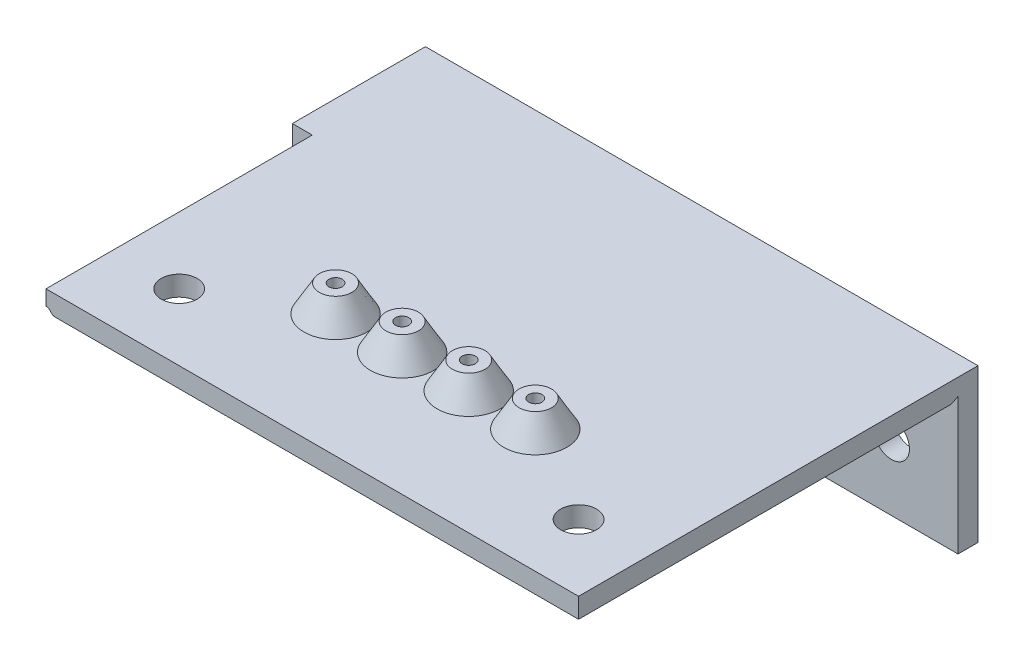
ISO-10303-21;
HEADER;
FILE_DESCRIPTION(('STEP AP214'),'2;1');
FILE_NAME('part.step','',(''),(''),'','','');
FILE_SCHEMA(('AUTOMOTIVE_DESIGN { 1 0 10303 214 1 1 1 1 }'));
ENDSEC;
DATA;
#1=APPLICATION_CONTEXT('core data for automotive mechanical design processes');
#2=APPLICATION_PROTOCOL_DEFINITION('international standard','automotive_design',2000,#1);
#3=PRODUCT_CONTEXT('',#1,'mechanical');
#4=PRODUCT('Part','Part','',(#3));
#5=PRODUCT_RELATED_PRODUCT_CATEGORY('part','',(#4));
#6=PRODUCT_DEFINITION_FORMATION('','',#4);
#7=PRODUCT_DEFINITION_CONTEXT('part definition',#1,'design');
#8=PRODUCT_DEFINITION('design','',#6,#7);
#9=PRODUCT_DEFINITION_SHAPE('','',#8);
#10=(LENGTH_UNIT() NAMED_UNIT(*) SI_UNIT(.MILLI.,.METRE.));
#11=(NAMED_UNIT(*) PLANE_ANGLE_UNIT() SI_UNIT($,.RADIAN.));
#12=(NAMED_UNIT(*) SI_UNIT($,.STERADIAN.) SOLID_ANGLE_UNIT());
#13=UNCERTAINTY_MEASURE_WITH_UNIT(LENGTH_MEASURE(1.E-05),#10,'distance_accuracy_value','');
#14=(GEOMETRIC_REPRESENTATION_CONTEXT(3) GLOBAL_UNCERTAINTY_ASSIGNED_CONTEXT((#13)) GLOBAL_UNIT_ASSIGNED_CONTEXT((#10,
#11,#12)) REPRESENTATION_CONTEXT('',''));
#15=CARTESIAN_POINT('',(0.,0.,0.));
#16=DIRECTION('',(0.,0.,1.));
#17=DIRECTION('',(1.,0.,0.));
#18=AXIS2_PLACEMENT_3D('',#15,#16,#17);
#19=CARTESIAN_POINT('',(-40.,10.,60.));
#20=DIRECTION('',(1.,0.,0.));
#21=DIRECTION('',(0.,0.,-1.));
#22=AXIS2_PLACEMENT_3D('',#19,#20,#21);
#23=PLANE('',#22);
#24=DIRECTION('',(0.,0.,-1.));
#25=VECTOR('',#24,1.);
#26=CARTESIAN_POINT('',(-40.,10.75,62.8535533905933));
#27=LINE('',#26,#25);
#28=CARTESIAN_POINT('',(-40.,10.75,60.));
#29=VERTEX_POINT('',#28);
#30=CARTESIAN_POINT('',(-40.,10.75,20.));
#31=VERTEX_POINT('',#30);
#32=EDGE_CURVE('E186',#29,#31,#27,.T.);
#33=ORIENTED_EDGE('',*,*,#32,.F.);
#34=DIRECTION('',(0.,-1.,0.));
#35=VECTOR('',#34,1.);
#36=CARTESIAN_POINT('',(-40.,10.,60.));
#37=LINE('',#36,#35);
#38=CARTESIAN_POINT('',(-40.,13.,60.));
#39=VERTEX_POINT('',#38);
#40=EDGE_CURVE('E266',#39,#29,#37,.T.);
#41=ORIENTED_EDGE('',*,*,#40,.F.);
#42=DIRECTION('',(0.,0.,-1.));
#43=VECTOR('',#42,1.);
#44=CARTESIAN_POINT('',(-40.,13.,60.));
#45=LINE('',#44,#43);
#46=CARTESIAN_POINT('',(-40.,13.,20.));
#47=VERTEX_POINT('',#46);
#48=EDGE_CURVE('E276',#39,#47,#45,.T.);
#49=ORIENTED_EDGE('',*,*,#48,.T.);
#50=DIRECTION('',(0.,-1.,0.));
#51=VECTOR('',#50,1.);
#52=CARTESIAN_POINT('',(-40.,10.,20.));
#53=LINE('',#52,#51);
#54=EDGE_CURVE('E265',#47,#31,#53,.T.);
#55=ORIENTED_EDGE('',*,*,#54,.T.);
#56=EDGE_LOOP('',(#33,#41,#49,#55));
#57=FACE_BOUND('',#56,.T.);
#58=ADVANCED_FACE('F35',(#57),#23,.F.);
#59=CARTESIAN_POINT('',(0.,0.,60.));
#60=DIRECTION('',(0.,0.,-1.));
#61=DIRECTION('',(-1.,0.,0.));
#62=AXIS2_PLACEMENT_3D('',#59,#60,#61);
#63=PLANE('',#62);
#64=CARTESIAN_POINT('',(-38.7322330470336,10.5,60.));
#65=DIRECTION('',(0.,0.,-1.));
#66=DIRECTION('',(-1.,0.,0.));
#67=AXIS2_PLACEMENT_3D('',#64,#65,#66);
#68=CIRCLE('',#67,0.500000000000001);
#69=CARTESIAN_POINT('',(-39.0857864376269,10.1464466094067,60.));
#70=VERTEX_POINT('',#69);
#71=CARTESIAN_POINT('',(-38.7322330470336,10.,60.));
#72=VERTEX_POINT('',#71);
#73=EDGE_CURVE('E187',#70,#72,#68,.F.);
#74=ORIENTED_EDGE('',*,*,#73,.T.);
#75=DIRECTION('',(1.,0.,0.));
#76=VECTOR('',#75,1.);
#77=CARTESIAN_POINT('',(-40.,10.,60.));
#78=LINE('',#77,#76);
#79=CARTESIAN_POINT('',(40.,10.,60.));
#80=VERTEX_POINT('',#79);
#81=EDGE_CURVE('E269',#72,#80,#78,.T.);
#82=ORIENTED_EDGE('',*,*,#81,.T.);
#83=DIRECTION('',(0.,1.,0.));
#84=VECTOR('',#83,1.);
#85=CARTESIAN_POINT('',(40.,10.,60.));
#86=LINE('',#85,#84);
#87=CARTESIAN_POINT('',(40.,13.,60.));
#88=VERTEX_POINT('',#87);
#89=EDGE_CURVE('E271',#80,#88,#86,.T.);
#90=ORIENTED_EDGE('',*,*,#89,.T.);
#91=DIRECTION('',(-1.,0.,0.));
#92=VECTOR('',#91,1.);
#93=CARTESIAN_POINT('',(-40.,13.,60.));
#94=LINE('',#93,#92);
#95=EDGE_CURVE('E274',#88,#39,#94,.T.);
#96=ORIENTED_EDGE('',*,*,#95,.T.);
#97=ORIENTED_EDGE('',*,*,#40,.T.);
#98=CARTESIAN_POINT('',(-40.,10.,60.));
#99=DIRECTION('',(0.,0.,-1.));
#100=DIRECTION('',(-1.,0.,0.));
#101=AXIS2_PLACEMENT_3D('',#98,#99,#100);
#102=CIRCLE('',#101,0.75);
#103=CARTESIAN_POINT('',(-39.4696699141101,10.5303300858899,60.));
#104=VERTEX_POINT('',#103);
#105=EDGE_CURVE('E309',#104,#29,#102,.F.);
#106=ORIENTED_EDGE('',*,*,#105,.F.);
#107=DIRECTION('',(-0.707106781186551,0.707106781186544,0.));
#108=VECTOR('',#107,1.);
#109=CARTESIAN_POINT('',(-39.4696699141101,10.5303300858899,60.));
#110=LINE('',#109,#108);
#111=EDGE_CURVE('E184',#70,#104,#110,.T.);
#112=ORIENTED_EDGE('',*,*,#111,.F.);
#113=EDGE_LOOP('',(#74,#82,#90,#96,#97,#106,#112));
#114=FACE_BOUND('',#113,.T.);
#115=ADVANCED_FACE('F352',(#114),#63,.F.);
#116=CARTESIAN_POINT('',(0.,10.,20.));
#117=DIRECTION('',(0.,1.,0.));
#118=DIRECTION('',(0.,0.,1.));
#119=AXIS2_PLACEMENT_3D('',#116,#117,#118);
#120=PLANE('',#119);
#121=CARTESIAN_POINT('',(15.,10.,41.5));
#122=DIRECTION('',(0.,1.,0.));
#123=DIRECTION('',(0.,0.,1.));
#124=AXIS2_PLACEMENT_3D('',#121,#122,#123);
#125=CIRCLE('',#124,1.);
#126=CARTESIAN_POINT('',(15.,10.,42.5));
#127=VERTEX_POINT('',#126);
#128=EDGE_CURVE('E217',#127,#127,#125,.F.);
#129=ORIENTED_EDGE('',*,*,#128,.F.);
#130=EDGE_LOOP('',(#129));
#131=FACE_BOUND('',#130,.T.);
#132=CARTESIAN_POINT('',(-15.,10.,41.5));
#133=DIRECTION('',(0.,1.,0.));
#134=DIRECTION('',(0.,0.,1.));
#135=AXIS2_PLACEMENT_3D('',#132,#133,#134);
#136=CIRCLE('',#135,1.);
#137=CARTESIAN_POINT('',(-15.,10.,42.5));
#138=VERTEX_POINT('',#137);
#139=EDGE_CURVE('E235',#138,#138,#136,.T.);
#140=ORIENTED_EDGE('',*,*,#139,.T.);
#141=EDGE_LOOP('',(#140));
#142=FACE_BOUND('',#141,.T.);
#143=DIRECTION('',(0.,0.,-1.));
#144=VECTOR('',#143,1.);
#145=CARTESIAN_POINT('',(-38.7322330470336,10.,62.8535533905933));
#146=LINE('',#145,#144);
#147=CARTESIAN_POINT('',(-38.7322330470336,10.,4.));
#148=VERTEX_POINT('',#147);
#149=EDGE_CURVE('E206',#72,#148,#146,.T.);
#150=ORIENTED_EDGE('',*,*,#149,.T.);
#151=DIRECTION('',(1.,0.,0.));
#152=VECTOR('',#151,1.);
#153=CARTESIAN_POINT('',(-40.,10.,4.));
#154=LINE('',#153,#152);
#155=CARTESIAN_POINT('',(40.,10.,4.));
#156=VERTEX_POINT('',#155);
#157=EDGE_CURVE('E163',#148,#156,#154,.T.);
#158=ORIENTED_EDGE('',*,*,#157,.T.);
#159=DIRECTION('',(0.,0.,-1.));
#160=VECTOR('',#159,1.);
#161=CARTESIAN_POINT('',(40.,10.,20.));
#162=LINE('',#161,#160);
#163=EDGE_CURVE('E169',#80,#156,#162,.T.);
#164=ORIENTED_EDGE('',*,*,#163,.F.);
#165=ORIENTED_EDGE('',*,*,#81,.F.);
#166=EDGE_LOOP('',(#150,#158,#164,#165));
#167=FACE_BOUND('',#166,.T.);
#168=CARTESIAN_POINT('',(30.,10.,50.));
#169=DIRECTION('',(0.,1.,0.));
#170=DIRECTION('',(0.,0.,1.));
#171=AXIS2_PLACEMENT_3D('',#168,#169,#170);
#172=CIRCLE('',#171,2.7);
#173=CARTESIAN_POINT('',(30.,10.,52.7));
#174=VERTEX_POINT('',#173);
#175=EDGE_CURVE('E247',#174,#174,#172,.F.);
#176=ORIENTED_EDGE('',*,*,#175,.F.);
#177=EDGE_LOOP('',(#176));
#178=FACE_BOUND('',#177,.T.);
#179=CARTESIAN_POINT('',(-30.,10.,50.));
#180=DIRECTION('',(0.,1.,0.));
#181=DIRECTION('',(0.,0.,1.));
#182=AXIS2_PLACEMENT_3D('',#179,#180,#181);
#183=CIRCLE('',#182,2.7);
#184=CARTESIAN_POINT('',(-30.,10.,52.7));
#185=VERTEX_POINT('',#184);
#186=EDGE_CURVE('E241',#185,#185,#183,.T.);
#187=ORIENTED_EDGE('',*,*,#186,.T.);
#188=EDGE_LOOP('',(#187));
#189=FACE_BOUND('',#188,.T.);
#190=CARTESIAN_POINT('',(-4.99999999999999,10.,41.5));
#191=DIRECTION('',(0.,1.,0.));
#192=DIRECTION('',(0.,0.,1.));
#193=AXIS2_PLACEMENT_3D('',#190,#191,#192);
#194=CIRCLE('',#193,1.);
#195=CARTESIAN_POINT('',(-4.99999999999999,10.,42.5));
#196=VERTEX_POINT('',#195);
#197=EDGE_CURVE('E229',#196,#196,#194,.F.);
#198=ORIENTED_EDGE('',*,*,#197,.F.);
#199=EDGE_LOOP('',(#198));
#200=FACE_BOUND('',#199,.T.);
#201=CARTESIAN_POINT('',(5.,10.,41.5));
#202=DIRECTION('',(0.,1.,0.));
#203=DIRECTION('',(0.,0.,1.));
#204=AXIS2_PLACEMENT_3D('',#201,#202,#203);
#205=CIRCLE('',#204,1.);
#206=CARTESIAN_POINT('',(5.,10.,42.5));
#207=VERTEX_POINT('',#206);
#208=EDGE_CURVE('E223',#207,#207,#205,.T.);
#209=ORIENTED_EDGE('',*,*,#208,.T.);
#210=EDGE_LOOP('',(#209));
#211=FACE_BOUND('',#210,.T.);
#212=ADVANCED_FACE('F428',(#131,#142,#167,#178,#189,#200,#211),#120,.F.);
#213=CARTESIAN_POINT('',(0.,17.,0.));
#214=DIRECTION('',(0.,1.,0.));
#215=DIRECTION('',(0.,0.,1.));
#216=AXIS2_PLACEMENT_3D('',#213,#214,#215);
#217=PLANE('',#216);
#218=CARTESIAN_POINT('',(5.,17.,41.5));
#219=DIRECTION('',(0.,1.,0.));
#220=DIRECTION('',(0.,0.,1.));
#221=AXIS2_PLACEMENT_3D('',#218,#219,#220);
#222=CIRCLE('',#221,2.44059892324149);
#223=CARTESIAN_POINT('',(5.,17.,43.9405989232415));
#224=VERTEX_POINT('',#223);
#225=EDGE_CURVE('E259',#224,#224,#222,.F.);
#226=ORIENTED_EDGE('',*,*,#225,.F.);
#227=EDGE_LOOP('',(#226));
#228=FACE_BOUND('',#227,.T.);
#229=CARTESIAN_POINT('',(5.,17.,41.5));
#230=DIRECTION('',(0.,1.,0.));
#231=DIRECTION('',(0.,0.,1.));
#232=AXIS2_PLACEMENT_3D('',#229,#230,#231);
#233=CIRCLE('',#232,1.);
#234=CARTESIAN_POINT('',(5.,17.,42.5));
#235=VERTEX_POINT('',#234);
#236=EDGE_CURVE('E226',#235,#235,#233,.F.);
#237=ORIENTED_EDGE('',*,*,#236,.T.);
#238=EDGE_LOOP('',(#237));
#239=FACE_BOUND('',#238,.T.);
#240=ADVANCED_FACE('F437',(#228,#239),#217,.T.);
#241=CARTESIAN_POINT('',(0.,17.,0.));
#242=DIRECTION('',(0.,1.,0.));
#243=DIRECTION('',(0.,0.,1.));
#244=AXIS2_PLACEMENT_3D('',#241,#242,#243);
#245=PLANE('',#244);
#246=CARTESIAN_POINT('',(-15.,17.,41.5));
#247=DIRECTION('',(0.,1.,0.));
#248=DIRECTION('',(0.,0.,1.));
#249=AXIS2_PLACEMENT_3D('',#246,#247,#248);
#250=CIRCLE('',#249,2.44059892324149);
#251=CARTESIAN_POINT('',(-15.,17.,43.9405989232415));
#252=VERTEX_POINT('',#251);
#253=EDGE_CURVE('E253',#252,#252,#250,.F.);
#254=ORIENTED_EDGE('',*,*,#253,.F.);
#255=EDGE_LOOP('',(#254));
#256=FACE_BOUND('',#255,.T.);
#257=CARTESIAN_POINT('',(-15.,17.,41.5));
#258=DIRECTION('',(0.,1.,0.));
#259=DIRECTION('',(0.,0.,1.));
#260=AXIS2_PLACEMENT_3D('',#257,#258,#259);
#261=CIRCLE('',#260,1.);
#262=CARTESIAN_POINT('',(-15.,17.,42.5));
#263=VERTEX_POINT('',#262);
#264=EDGE_CURVE('E238',#263,#263,#261,.F.);
#265=ORIENTED_EDGE('',*,*,#264,.T.);
#266=EDGE_LOOP('',(#265));
#267=FACE_BOUND('',#266,.T.);
#268=ADVANCED_FACE('F442',(#256,#267),#245,.T.);
#269=CARTESIAN_POINT('',(0.,13.,20.));
#270=DIRECTION('',(0.,1.,0.));
#271=DIRECTION('',(0.,0.,1.));
#272=AXIS2_PLACEMENT_3D('',#269,#270,#271);
#273=PLANE('',#272);
#274=DIRECTION('',(1.,0.,0.));
#275=VECTOR('',#274,1.);
#276=CARTESIAN_POINT('',(0.,13.,0.));
#277=LINE('',#276,#275);
#278=CARTESIAN_POINT('',(-43.,13.,0.));
#279=VERTEX_POINT('',#278);
#280=CARTESIAN_POINT('',(40.,13.,0.));
#281=VERTEX_POINT('',#280);
#282=EDGE_CURVE('E294',#279,#281,#277,.T.);
#283=ORIENTED_EDGE('',*,*,#282,.F.);
#284=DIRECTION('',(0.,0.,-1.));
#285=VECTOR('',#284,1.);
#286=CARTESIAN_POINT('',(-43.,13.,20.));
#287=LINE('',#286,#285);
#288=CARTESIAN_POINT('',(-43.,13.,20.));
#289=VERTEX_POINT('',#288);
#290=EDGE_CURVE('E362',#289,#279,#287,.T.);
#291=ORIENTED_EDGE('',*,*,#290,.F.);
#292=DIRECTION('',(1.,0.,0.));
#293=VECTOR('',#292,1.);
#294=CARTESIAN_POINT('',(0.,13.,20.));
#295=LINE('',#294,#293);
#296=EDGE_CURVE('E282',#289,#47,#295,.T.);
#297=ORIENTED_EDGE('',*,*,#296,.T.);
#298=ORIENTED_EDGE('',*,*,#48,.F.);
#299=ORIENTED_EDGE('',*,*,#95,.F.);
#300=DIRECTION('',(0.,0.,-1.));
#301=VECTOR('',#300,1.);
#302=CARTESIAN_POINT('',(40.,13.,20.));
#303=LINE('',#302,#301);
#304=EDGE_CURVE('E381',#88,#281,#303,.T.);
#305=ORIENTED_EDGE('',*,*,#304,.T.);
#306=EDGE_LOOP('',(#283,#291,#297,#298,#299,#305));
#307=FACE_BOUND('',#306,.T.);
#308=CARTESIAN_POINT('',(15.,13.,41.5));
#309=DIRECTION('',(0.,1.,0.));
#310=DIRECTION('',(0.,0.,1.));
#311=AXIS2_PLACEMENT_3D('',#308,#309,#310);
#312=CIRCLE('',#311,4.75);
#313=CARTESIAN_POINT('',(15.,13.,46.25));
#314=VERTEX_POINT('',#313);
#315=EDGE_CURVE('E297',#314,#314,#312,.T.);
#316=ORIENTED_EDGE('',*,*,#315,.F.);
#317=EDGE_LOOP('',(#316));
#318=FACE_BOUND('',#317,.T.);
#319=CARTESIAN_POINT('',(5.,13.,41.5));
#320=DIRECTION('',(0.,1.,0.));
#321=DIRECTION('',(0.,0.,1.));
#322=AXIS2_PLACEMENT_3D('',#319,#320,#321);
#323=CIRCLE('',#322,4.75);
#324=CARTESIAN_POINT('',(5.,13.,46.25));
#325=VERTEX_POINT('',#324);
#326=EDGE_CURVE('E300',#325,#325,#323,.T.);
#327=ORIENTED_EDGE('',*,*,#326,.F.);
#328=EDGE_LOOP('',(#327));
#329=FACE_BOUND('',#328,.T.);
#330=CARTESIAN_POINT('',(-4.99999999999999,13.,41.5));
#331=DIRECTION('',(0.,1.,0.));
#332=DIRECTION('',(0.,0.,1.));
#333=AXIS2_PLACEMENT_3D('',#330,#331,#332);
#334=CIRCLE('',#333,4.75);
#335=CARTESIAN_POINT('',(-4.99999999999999,13.,46.25));
#336=VERTEX_POINT('',#335);
#337=EDGE_CURVE('E303',#336,#336,#334,.T.);
#338=ORIENTED_EDGE('',*,*,#337,.F.);
#339=EDGE_LOOP('',(#338));
#340=FACE_BOUND('',#339,.T.);
#341=CARTESIAN_POINT('',(-15.,13.,41.5));
#342=DIRECTION('',(0.,1.,0.));
#343=DIRECTION('',(0.,0.,1.));
#344=AXIS2_PLACEMENT_3D('',#341,#342,#343);
#345=CIRCLE('',#344,4.75);
#346=CARTESIAN_POINT('',(-15.,13.,46.25));
#347=VERTEX_POINT('',#346);
#348=EDGE_CURVE('E306',#347,#347,#345,.T.);
#349=ORIENTED_EDGE('',*,*,#348,.F.);
#350=EDGE_LOOP('',(#349));
#351=FACE_BOUND('',#350,.T.);
#352=CARTESIAN_POINT('',(30.,13.,50.));
#353=DIRECTION('',(0.,1.,0.));
#354=DIRECTION('',(0.,0.,1.));
#355=AXIS2_PLACEMENT_3D('',#352,#353,#354);
#356=CIRCLE('',#355,2.7);
#357=CARTESIAN_POINT('',(30.,13.,52.7));
#358=VERTEX_POINT('',#357);
#359=EDGE_CURVE('E250',#358,#358,#356,.T.);
#360=ORIENTED_EDGE('',*,*,#359,.F.);
#361=EDGE_LOOP('',(#360));
#362=FACE_BOUND('',#361,.T.);
#363=CARTESIAN_POINT('',(-30.,13.,50.));
#364=DIRECTION('',(0.,1.,0.));
#365=DIRECTION('',(0.,0.,1.));
#366=AXIS2_PLACEMENT_3D('',#363,#364,#365);
#367=CIRCLE('',#366,2.7);
#368=CARTESIAN_POINT('',(-30.,13.,52.7));
#369=VERTEX_POINT('',#368);
#370=EDGE_CURVE('E244',#369,#369,#367,.F.);
#371=ORIENTED_EDGE('',*,*,#370,.T.);
#372=EDGE_LOOP('',(#371));
#373=FACE_BOUND('',#372,.T.);
#374=ADVANCED_FACE('F359',(#307,#318,#329,#340,#351,#362,#373),#273,.T.);
#375=CARTESIAN_POINT('',(0.,-10.,3.));
#376=DIRECTION('',(0.,1.,0.));
#377=DIRECTION('',(0.,0.,1.));
#378=AXIS2_PLACEMENT_3D('',#375,#376,#377);
#379=PLANE('',#378);
#380=DIRECTION('',(1.,0.,0.));
#381=VECTOR('',#380,1.);
#382=CARTESIAN_POINT('',(0.,-10.,3.));
#383=LINE('',#382,#381);
#384=CARTESIAN_POINT('',(-40.5,-10.,3.));
#385=VERTEX_POINT('',#384);
#386=CARTESIAN_POINT('',(40.,-10.,3.));
#387=VERTEX_POINT('',#386);
#388=EDGE_CURVE('E151',#385,#387,#383,.T.);
#389=ORIENTED_EDGE('',*,*,#388,.F.);
#390=DIRECTION('',(-0.447213595499958,0.,-0.894427190999916));
#391=VECTOR('',#390,1.);
#392=CARTESIAN_POINT('',(-40.5,-10.,3.));
#393=LINE('',#392,#391);
#394=CARTESIAN_POINT('',(-40.,-10.,4.));
#395=VERTEX_POINT('',#394);
#396=EDGE_CURVE('E175',#395,#385,#393,.T.);
#397=ORIENTED_EDGE('',*,*,#396,.F.);
#398=DIRECTION('',(0.,0.,-1.));
#399=VECTOR('',#398,1.);
#400=CARTESIAN_POINT('',(-40.,-10.,20.));
#401=LINE('',#400,#399);
#402=CARTESIAN_POINT('',(-40.,-10.,20.));
#403=VERTEX_POINT('',#402);
#404=EDGE_CURVE('E335',#403,#395,#401,.T.);
#405=ORIENTED_EDGE('',*,*,#404,.F.);
#406=DIRECTION('',(-1.,0.,0.));
#407=VECTOR('',#406,1.);
#408=CARTESIAN_POINT('',(0.,-10.,20.));
#409=LINE('',#408,#407);
#410=CARTESIAN_POINT('',(-43.,-10.,20.));
#411=VERTEX_POINT('',#410);
#412=EDGE_CURVE('E370',#403,#411,#409,.T.);
#413=ORIENTED_EDGE('',*,*,#412,.T.);
#414=DIRECTION('',(0.,0.,-1.));
#415=VECTOR('',#414,1.);
#416=CARTESIAN_POINT('',(-43.,-10.,20.));
#417=LINE('',#416,#415);
#418=CARTESIAN_POINT('',(-43.,-10.,0.));
#419=VERTEX_POINT('',#418);
#420=EDGE_CURVE('E369',#411,#419,#417,.T.);
#421=ORIENTED_EDGE('',*,*,#420,.T.);
#422=DIRECTION('',(1.,0.,0.));
#423=VECTOR('',#422,1.);
#424=CARTESIAN_POINT('',(0.,-10.,0.));
#425=LINE('',#424,#423);
#426=CARTESIAN_POINT('',(40.,-10.,0.));
#427=VERTEX_POINT('',#426);
#428=EDGE_CURVE('E407',#419,#427,#425,.T.);
#429=ORIENTED_EDGE('',*,*,#428,.T.);
#430=DIRECTION('',(0.,0.,-1.));
#431=VECTOR('',#430,1.);
#432=CARTESIAN_POINT('',(40.,-10.,3.));
#433=LINE('',#432,#431);
#434=EDGE_CURVE('E156',#387,#427,#433,.T.);
#435=ORIENTED_EDGE('',*,*,#434,.F.);
#436=EDGE_LOOP('',(#389,#397,#405,#413,#421,#429,#435));
#437=FACE_BOUND('',#436,.T.);
#438=ADVANCED_FACE('F338',(#437),#379,.F.);
#439=CARTESIAN_POINT('',(40.,0.,3.));
#440=DIRECTION('',(-1.,0.,0.));
#441=DIRECTION('',(0.,0.,1.));
#442=AXIS2_PLACEMENT_3D('',#439,#440,#441);
#443=PLANE('',#442);
#444=ORIENTED_EDGE('',*,*,#163,.T.);
#445=DIRECTION('',(0.,-0.447213595499958,0.894427190999916));
#446=VECTOR('',#445,1.);
#447=CARTESIAN_POINT('',(40.,10.5,3.));
#448=LINE('',#447,#446);
#449=CARTESIAN_POINT('',(40.,10.5,3.));
#450=VERTEX_POINT('',#449);
#451=EDGE_CURVE('E160',#450,#156,#448,.T.);
#452=ORIENTED_EDGE('',*,*,#451,.F.);
#453=DIRECTION('',(0.,1.,0.));
#454=VECTOR('',#453,1.);
#455=CARTESIAN_POINT('',(40.,0.,3.));
#456=LINE('',#455,#454);
#457=EDGE_CURVE('E148',#387,#450,#456,.T.);
#458=ORIENTED_EDGE('',*,*,#457,.F.);
#459=ORIENTED_EDGE('',*,*,#434,.T.);
#460=DIRECTION('',(0.,1.,0.));
#461=VECTOR('',#460,1.);
#462=CARTESIAN_POINT('',(40.,0.,0.));
#463=LINE('',#462,#461);
#464=EDGE_CURVE('E388',#427,#281,#463,.T.);
#465=ORIENTED_EDGE('',*,*,#464,.T.);
#466=ORIENTED_EDGE('',*,*,#304,.F.);
#467=ORIENTED_EDGE('',*,*,#89,.F.);
#468=EDGE_LOOP('',(#444,#452,#458,#459,#465,#466,#467));
#469=FACE_BOUND('',#468,.T.);
#470=ADVANCED_FACE('F166',(#469),#443,.F.);
#471=CARTESIAN_POINT('',(-30.,0.,3.));
#472=DIRECTION('',(0.,0.,-1.));
#473=DIRECTION('',(-1.,0.,0.));
#474=AXIS2_PLACEMENT_3D('',#471,#472,#473);
#475=CYLINDRICAL_SURFACE('',#474,2.7);
#476=CARTESIAN_POINT('',(-30.,0.,3.));
#477=DIRECTION('',(0.,0.,1.));
#478=DIRECTION('',(1.,0.,0.));
#479=AXIS2_PLACEMENT_3D('',#476,#477,#478);
#480=CIRCLE('',#479,2.7);
#481=CARTESIAN_POINT('',(-27.3,0.,3.));
#482=VERTEX_POINT('',#481);
#483=EDGE_CURVE('E341',#482,#482,#480,.T.);
#484=ORIENTED_EDGE('',*,*,#483,.T.);
#485=EDGE_LOOP('',(#484));
#486=FACE_BOUND('',#485,.T.);
#487=CARTESIAN_POINT('',(-30.,0.,0.));
#488=DIRECTION('',(0.,0.,1.));
#489=DIRECTION('',(1.,0.,0.));
#490=AXIS2_PLACEMENT_3D('',#487,#488,#489);
#491=CIRCLE('',#490,2.7);
#492=CARTESIAN_POINT('',(-27.3,0.,0.));
#493=VERTEX_POINT('',#492);
#494=EDGE_CURVE('E404',#493,#493,#491,.T.);
#495=ORIENTED_EDGE('',*,*,#494,.F.);
#496=EDGE_LOOP('',(#495));
#497=FACE_BOUND('',#496,.T.);
#498=ADVANCED_FACE('F685',(#486,#497),#475,.F.);
#499=CARTESIAN_POINT('',(-9.99999999999999,0.,3.));
#500=DIRECTION('',(0.,0.,-1.));
#501=DIRECTION('',(-1.,0.,0.));
#502=AXIS2_PLACEMENT_3D('',#499,#500,#501);
#503=CYLINDRICAL_SURFACE('',#502,2.7);
#504=CARTESIAN_POINT('',(-9.99999999999999,0.,3.));
#505=DIRECTION('',(0.,0.,1.));
#506=DIRECTION('',(1.,0.,0.));
#507=AXIS2_PLACEMENT_3D('',#504,#505,#506);
#508=CIRCLE('',#507,2.7);
#509=CARTESIAN_POINT('',(-7.29999999999999,0.,3.));
#510=VERTEX_POINT('',#509);
#511=EDGE_CURVE('E391',#510,#510,#508,.T.);
#512=ORIENTED_EDGE('',*,*,#511,.T.);
#513=EDGE_LOOP('',(#512));
#514=FACE_BOUND('',#513,.T.);
#515=CARTESIAN_POINT('',(-9.99999999999999,0.,0.));
#516=DIRECTION('',(0.,0.,1.));
#517=DIRECTION('',(1.,0.,0.));
#518=AXIS2_PLACEMENT_3D('',#515,#516,#517);
#519=CIRCLE('',#518,2.7);
#520=CARTESIAN_POINT('',(-7.29999999999999,0.,0.));
#521=VERTEX_POINT('',#520);
#522=EDGE_CURVE('E401',#521,#521,#519,.T.);
#523=ORIENTED_EDGE('',*,*,#522,.F.);
#524=EDGE_LOOP('',(#523));
#525=FACE_BOUND('',#524,.T.);
#526=ADVANCED_FACE('F772',(#514,#525),#503,.F.);
#527=CARTESIAN_POINT('',(10.,0.,3.));
#528=DIRECTION('',(0.,0.,-1.));
#529=DIRECTION('',(-1.,0.,0.));
#530=AXIS2_PLACEMENT_3D('',#527,#528,#529);
#531=CYLINDRICAL_SURFACE('',#530,2.7);
#532=CARTESIAN_POINT('',(10.,0.,3.));
#533=DIRECTION('',(0.,0.,1.));
#534=DIRECTION('',(1.,0.,0.));
#535=AXIS2_PLACEMENT_3D('',#532,#533,#534);
#536=CIRCLE('',#535,2.7);
#537=CARTESIAN_POINT('',(12.7,0.,3.));
#538=VERTEX_POINT('',#537);
#539=EDGE_CURVE('E387',#538,#538,#536,.T.);
#540=ORIENTED_EDGE('',*,*,#539,.T.);
#541=EDGE_LOOP('',(#540));
#542=FACE_BOUND('',#541,.T.);
#543=CARTESIAN_POINT('',(10.,0.,0.));
#544=DIRECTION('',(0.,0.,1.));
#545=DIRECTION('',(1.,0.,0.));
#546=AXIS2_PLACEMENT_3D('',#543,#544,#545);
#547=CIRCLE('',#546,2.7);
#548=CARTESIAN_POINT('',(12.7,0.,0.));
#549=VERTEX_POINT('',#548);
#550=EDGE_CURVE('E398',#549,#549,#547,.T.);
#551=ORIENTED_EDGE('',*,*,#550,.F.);
#552=EDGE_LOOP('',(#551));
#553=FACE_BOUND('',#552,.T.);
#554=ADVANCED_FACE('F766',(#542,#553),#531,.F.);
#555=CARTESIAN_POINT('',(30.,0.,3.));
#556=DIRECTION('',(0.,0.,-1.));
#557=DIRECTION('',(-1.,0.,0.));
#558=AXIS2_PLACEMENT_3D('',#555,#556,#557);
#559=CYLINDRICAL_SURFACE('',#558,2.7);
#560=CARTESIAN_POINT('',(30.,0.,3.));
#561=DIRECTION('',(0.,0.,1.));
#562=DIRECTION('',(1.,0.,0.));
#563=AXIS2_PLACEMENT_3D('',#560,#561,#562);
#564=CIRCLE('',#563,2.7);
#565=CARTESIAN_POINT('',(32.7,0.,3.));
#566=VERTEX_POINT('',#565);
#567=EDGE_CURVE('E384',#566,#566,#564,.T.);
#568=ORIENTED_EDGE('',*,*,#567,.T.);
#569=EDGE_LOOP('',(#568));
#570=FACE_BOUND('',#569,.T.);
#571=CARTESIAN_POINT('',(30.,0.,0.));
#572=DIRECTION('',(0.,0.,1.));
#573=DIRECTION('',(1.,0.,0.));
#574=AXIS2_PLACEMENT_3D('',#571,#572,#573);
#575=CIRCLE('',#574,2.7);
#576=CARTESIAN_POINT('',(32.7,0.,0.));
#577=VERTEX_POINT('',#576);
#578=EDGE_CURVE('E383',#577,#577,#575,.T.);
#579=ORIENTED_EDGE('',*,*,#578,.F.);
#580=EDGE_LOOP('',(#579));
#581=FACE_BOUND('',#580,.T.);
#582=ADVANCED_FACE('F37',(#570,#581),#559,.F.);
#583=CARTESIAN_POINT('',(0.,0.,3.));
#584=DIRECTION('',(0.,0.,1.));
#585=DIRECTION('',(1.,0.,0.));
#586=AXIS2_PLACEMENT_3D('',#583,#584,#585);
#587=PLANE('',#586);
#588=ORIENTED_EDGE('',*,*,#457,.T.);
#589=DIRECTION('',(1.,0.,0.));
#590=VECTOR('',#589,1.);
#591=CARTESIAN_POINT('',(-40.,10.5,3.));
#592=LINE('',#591,#590);
#593=CARTESIAN_POINT('',(-39.4393398282202,10.5,3.));
#594=VERTEX_POINT('',#593);
#595=EDGE_CURVE('E50',#594,#450,#592,.T.);
#596=ORIENTED_EDGE('',*,*,#595,.F.);
#597=DIRECTION('',(0.707106781186551,-0.707106781186544,0.));
#598=VECTOR('',#597,1.);
#599=CARTESIAN_POINT('',(-39.4696699141101,10.5303300858899,3.));
#600=LINE('',#599,#598);
#601=CARTESIAN_POINT('',(-39.4696699141101,10.5303300858899,3.));
#602=VERTEX_POINT('',#601);
#603=EDGE_CURVE('E183',#602,#594,#600,.T.);
#604=ORIENTED_EDGE('',*,*,#603,.F.);
#605=CARTESIAN_POINT('',(-40.,10.,3.));
#606=DIRECTION('',(0.,0.,1.));
#607=DIRECTION('',(1.,0.,0.));
#608=AXIS2_PLACEMENT_3D('',#605,#606,#607);
#609=CIRCLE('',#608,0.75);
#610=CARTESIAN_POINT('',(-40.5303300858899,9.4696699141101,3.));
#611=VERTEX_POINT('',#610);
#612=EDGE_CURVE('E192',#602,#611,#609,.T.);
#613=ORIENTED_EDGE('',*,*,#612,.T.);
#614=DIRECTION('',(0.707106781186544,-0.707106781186551,0.));
#615=VECTOR('',#614,1.);
#616=CARTESIAN_POINT('',(-40.5303300858899,9.46966991411009,3.));
#617=LINE('',#616,#615);
#618=CARTESIAN_POINT('',(-40.5,9.43933982822017,3.));
#619=VERTEX_POINT('',#618);
#620=EDGE_CURVE('E189',#611,#619,#617,.T.);
#621=ORIENTED_EDGE('',*,*,#620,.T.);
#622=DIRECTION('',(0.,-1.,0.));
#623=VECTOR('',#622,1.);
#624=CARTESIAN_POINT('',(-40.5,10.,3.));
#625=LINE('',#624,#623);
#626=EDGE_CURVE('E58',#619,#385,#625,.T.);
#627=ORIENTED_EDGE('',*,*,#626,.T.);
#628=ORIENTED_EDGE('',*,*,#388,.T.);
#629=EDGE_LOOP('',(#588,#596,#604,#613,#621,#627,#628));
#630=FACE_BOUND('',#629,.T.);
#631=ORIENTED_EDGE('',*,*,#567,.F.);
#632=EDGE_LOOP('',(#631));
#633=FACE_BOUND('',#632,.T.);
#634=ORIENTED_EDGE('',*,*,#539,.F.);
#635=EDGE_LOOP('',(#634));
#636=FACE_BOUND('',#635,.T.);
#637=ORIENTED_EDGE('',*,*,#511,.F.);
#638=EDGE_LOOP('',(#637));
#639=FACE_BOUND('',#638,.T.);
#640=ORIENTED_EDGE('',*,*,#483,.F.);
#641=EDGE_LOOP('',(#640));
#642=FACE_BOUND('',#641,.T.);
#643=ADVANCED_FACE('F149',(#630,#633,#636,#639,#642),#587,.T.);
#644=CARTESIAN_POINT('',(0.,0.,0.));
#645=DIRECTION('',(0.,0.,1.));
#646=DIRECTION('',(1.,0.,0.));
#647=AXIS2_PLACEMENT_3D('',#644,#645,#646);
#648=PLANE('',#647);
#649=ORIENTED_EDGE('',*,*,#578,.T.);
#650=EDGE_LOOP('',(#649));
#651=FACE_BOUND('',#650,.T.);
#652=ORIENTED_EDGE('',*,*,#550,.T.);
#653=EDGE_LOOP('',(#652));
#654=FACE_BOUND('',#653,.T.);
#655=ORIENTED_EDGE('',*,*,#522,.T.);
#656=EDGE_LOOP('',(#655));
#657=FACE_BOUND('',#656,.T.);
#658=ORIENTED_EDGE('',*,*,#494,.T.);
#659=EDGE_LOOP('',(#658));
#660=FACE_BOUND('',#659,.T.);
#661=ORIENTED_EDGE('',*,*,#428,.F.);
#662=DIRECTION('',(0.,1.,0.));
#663=VECTOR('',#662,1.);
#664=CARTESIAN_POINT('',(-43.,0.,0.));
#665=LINE('',#664,#663);
#666=EDGE_CURVE('E286',#419,#279,#665,.T.);
#667=ORIENTED_EDGE('',*,*,#666,.T.);
#668=ORIENTED_EDGE('',*,*,#282,.T.);
#669=ORIENTED_EDGE('',*,*,#464,.F.);
#670=EDGE_LOOP('',(#661,#667,#668,#669));
#671=FACE_BOUND('',#670,.T.);
#672=ADVANCED_FACE('F409',(#651,#654,#657,#660,#671),#648,.F.);
#673=CARTESIAN_POINT('',(-43.,0.,20.));
#674=DIRECTION('',(-1.,0.,0.));
#675=DIRECTION('',(0.,0.,1.));
#676=AXIS2_PLACEMENT_3D('',#673,#674,#675);
#677=PLANE('',#676);
#678=ORIENTED_EDGE('',*,*,#666,.F.);
#679=ORIENTED_EDGE('',*,*,#420,.F.);
#680=DIRECTION('',(0.,1.,0.));
#681=VECTOR('',#680,1.);
#682=CARTESIAN_POINT('',(-43.,0.,20.));
#683=LINE('',#682,#681);
#684=EDGE_CURVE('E279',#411,#289,#683,.T.);
#685=ORIENTED_EDGE('',*,*,#684,.T.);
#686=ORIENTED_EDGE('',*,*,#290,.T.);
#687=EDGE_LOOP('',(#678,#679,#685,#686));
#688=FACE_BOUND('',#687,.T.);
#689=ADVANCED_FACE('F367',(#688),#677,.T.);
#690=CARTESIAN_POINT('',(-40.,0.,20.));
#691=DIRECTION('',(-1.,0.,0.));
#692=DIRECTION('',(0.,0.,1.));
#693=AXIS2_PLACEMENT_3D('',#690,#691,#692);
#694=PLANE('',#693);
#695=ORIENTED_EDGE('',*,*,#404,.T.);
#696=DIRECTION('',(0.,-1.,0.));
#697=VECTOR('',#696,1.);
#698=CARTESIAN_POINT('',(-40.,10.,4.));
#699=LINE('',#698,#697);
#700=CARTESIAN_POINT('',(-40.,8.73223304703363,3.99999999999999));
#701=VERTEX_POINT('',#700);
#702=EDGE_CURVE('E177',#701,#395,#699,.T.);
#703=ORIENTED_EDGE('',*,*,#702,.F.);
#704=DIRECTION('',(0.,0.,-1.));
#705=VECTOR('',#704,1.);
#706=CARTESIAN_POINT('',(-40.,8.73223304703363,62.8535533905933));
#707=LINE('',#706,#705);
#708=CARTESIAN_POINT('',(-40.,8.73223304703363,20.));
#709=VERTEX_POINT('',#708);
#710=EDGE_CURVE('E203',#709,#701,#707,.T.);
#711=ORIENTED_EDGE('',*,*,#710,.F.);
#712=DIRECTION('',(0.,1.,0.));
#713=VECTOR('',#712,1.);
#714=CARTESIAN_POINT('',(-40.,0.,20.));
#715=LINE('',#714,#713);
#716=EDGE_CURVE('E331',#403,#709,#715,.T.);
#717=ORIENTED_EDGE('',*,*,#716,.F.);
#718=EDGE_LOOP('',(#695,#703,#711,#717));
#719=FACE_BOUND('',#718,.T.);
#720=ADVANCED_FACE('F334',(#719),#694,.F.);
#721=CARTESIAN_POINT('',(0.,0.,20.));
#722=DIRECTION('',(0.,0.,1.));
#723=DIRECTION('',(1.,0.,0.));
#724=AXIS2_PLACEMENT_3D('',#721,#722,#723);
#725=PLANE('',#724);
#726=CARTESIAN_POINT('',(-40.5,8.73223304703363,20.));
#727=DIRECTION('',(0.,0.,1.));
#728=DIRECTION('',(1.,0.,0.));
#729=AXIS2_PLACEMENT_3D('',#726,#727,#728);
#730=CIRCLE('',#729,0.499999999999996);
#731=CARTESIAN_POINT('',(-40.1464466094067,9.0857864376269,20.));
#732=VERTEX_POINT('',#731);
#733=EDGE_CURVE('E314',#732,#709,#730,.F.);
#734=ORIENTED_EDGE('',*,*,#733,.F.);
#735=DIRECTION('',(-0.707106781186544,0.707106781186551,0.));
#736=VECTOR('',#735,1.);
#737=CARTESIAN_POINT('',(-15.5303300858901,-15.53033008589,20.));
#738=LINE('',#737,#736);
#739=CARTESIAN_POINT('',(-40.5303300858899,9.4696699141101,20.));
#740=VERTEX_POINT('',#739);
#741=EDGE_CURVE('E311',#732,#740,#738,.T.);
#742=ORIENTED_EDGE('',*,*,#741,.T.);
#743=CARTESIAN_POINT('',(-40.,10.,20.));
#744=DIRECTION('',(0.,0.,1.));
#745=DIRECTION('',(1.,0.,0.));
#746=AXIS2_PLACEMENT_3D('',#743,#744,#745);
#747=CIRCLE('',#746,0.75);
#748=EDGE_CURVE('E214',#740,#31,#747,.F.);
#749=ORIENTED_EDGE('',*,*,#748,.T.);
#750=ORIENTED_EDGE('',*,*,#54,.F.);
#751=ORIENTED_EDGE('',*,*,#296,.F.);
#752=ORIENTED_EDGE('',*,*,#684,.F.);
#753=ORIENTED_EDGE('',*,*,#412,.F.);
#754=ORIENTED_EDGE('',*,*,#716,.T.);
#755=EDGE_LOOP('',(#734,#742,#749,#750,#751,#752,#753,#754));
#756=FACE_BOUND('',#755,.T.);
#757=ADVANCED_FACE('F327',(#756),#725,.T.);
#758=CARTESIAN_POINT('',(15.,13.,41.5));
#759=DIRECTION('',(0.,-1.,0.));
#760=DIRECTION('',(0.,0.,1.));
#761=AXIS2_PLACEMENT_3D('',#758,#759,#760);
#762=CONICAL_SURFACE('',#761,4.75,0.5235987755983);
#763=CARTESIAN_POINT('',(15.,17.,41.5));
#764=DIRECTION('',(0.,1.,0.));
#765=DIRECTION('',(0.,0.,1.));
#766=AXIS2_PLACEMENT_3D('',#763,#764,#765);
#767=CIRCLE('',#766,2.44059892324149);
#768=CARTESIAN_POINT('',(15.,17.,43.9405989232415));
#769=VERTEX_POINT('',#768);
#770=EDGE_CURVE('E262',#769,#769,#767,.F.);
#771=ORIENTED_EDGE('',*,*,#770,.T.);
#772=EDGE_LOOP('',(#771));
#773=FACE_BOUND('',#772,.T.);
#774=ORIENTED_EDGE('',*,*,#315,.T.);
#775=EDGE_LOOP('',(#774));
#776=FACE_BOUND('',#775,.T.);
#777=ADVANCED_FACE('F434',(#773,#776),#762,.T.);
#778=CARTESIAN_POINT('',(0.,17.,0.));
#779=DIRECTION('',(0.,1.,0.));
#780=DIRECTION('',(0.,0.,1.));
#781=AXIS2_PLACEMENT_3D('',#778,#779,#780);
#782=PLANE('',#781);
#783=CARTESIAN_POINT('',(15.,17.,41.5));
#784=DIRECTION('',(0.,1.,0.));
#785=DIRECTION('',(0.,0.,1.));
#786=AXIS2_PLACEMENT_3D('',#783,#784,#785);
#787=CIRCLE('',#786,1.);
#788=CARTESIAN_POINT('',(15.,17.,42.5));
#789=VERTEX_POINT('',#788);
#790=EDGE_CURVE('E220',#789,#789,#787,.T.);
#791=ORIENTED_EDGE('',*,*,#790,.F.);
#792=EDGE_LOOP('',(#791));
#793=FACE_BOUND('',#792,.T.);
#794=ORIENTED_EDGE('',*,*,#770,.F.);
#795=EDGE_LOOP('',(#794));
#796=FACE_BOUND('',#795,.T.);
#797=ADVANCED_FACE('F477',(#793,#796),#782,.T.);
#798=CARTESIAN_POINT('',(5.,13.,41.5));
#799=DIRECTION('',(0.,-1.,0.));
#800=DIRECTION('',(0.,0.,1.));
#801=AXIS2_PLACEMENT_3D('',#798,#799,#800);
#802=CONICAL_SURFACE('',#801,4.75,0.5235987755983);
#803=ORIENTED_EDGE('',*,*,#225,.T.);
#804=EDGE_LOOP('',(#803));
#805=FACE_BOUND('',#804,.T.);
#806=ORIENTED_EDGE('',*,*,#326,.T.);
#807=EDGE_LOOP('',(#806));
#808=FACE_BOUND('',#807,.T.);
#809=ADVANCED_FACE('F472',(#805,#808),#802,.T.);
#810=CARTESIAN_POINT('',(-4.99999999999999,13.,41.5));
#811=DIRECTION('',(0.,-1.,0.));
#812=DIRECTION('',(0.,0.,1.));
#813=AXIS2_PLACEMENT_3D('',#810,#811,#812);
#814=CONICAL_SURFACE('',#813,4.75,0.5235987755983);
#815=CARTESIAN_POINT('',(-4.99999999999999,17.,41.5));
#816=DIRECTION('',(0.,1.,0.));
#817=DIRECTION('',(0.,0.,1.));
#818=AXIS2_PLACEMENT_3D('',#815,#816,#817);
#819=CIRCLE('',#818,2.44059892324149);
#820=CARTESIAN_POINT('',(-4.99999999999999,17.,43.9405989232415));
#821=VERTEX_POINT('',#820);
#822=EDGE_CURVE('E256',#821,#821,#819,.F.);
#823=ORIENTED_EDGE('',*,*,#822,.T.);
#824=EDGE_LOOP('',(#823));
#825=FACE_BOUND('',#824,.T.);
#826=ORIENTED_EDGE('',*,*,#337,.T.);
#827=EDGE_LOOP('',(#826));
#828=FACE_BOUND('',#827,.T.);
#829=ADVANCED_FACE('F469',(#825,#828),#814,.T.);
#830=CARTESIAN_POINT('',(0.,17.,0.));
#831=DIRECTION('',(0.,1.,0.));
#832=DIRECTION('',(0.,0.,1.));
#833=AXIS2_PLACEMENT_3D('',#830,#831,#832);
#834=PLANE('',#833);
#835=CARTESIAN_POINT('',(-4.99999999999999,17.,41.5));
#836=DIRECTION('',(0.,1.,0.));
#837=DIRECTION('',(0.,0.,1.));
#838=AXIS2_PLACEMENT_3D('',#835,#836,#837);
#839=CIRCLE('',#838,1.);
#840=CARTESIAN_POINT('',(-4.99999999999999,17.,42.5));
#841=VERTEX_POINT('',#840);
#842=EDGE_CURVE('E232',#841,#841,#839,.T.);
#843=ORIENTED_EDGE('',*,*,#842,.F.);
#844=EDGE_LOOP('',(#843));
#845=FACE_BOUND('',#844,.T.);
#846=ORIENTED_EDGE('',*,*,#822,.F.);
#847=EDGE_LOOP('',(#846));
#848=FACE_BOUND('',#847,.T.);
#849=ADVANCED_FACE('F465',(#845,#848),#834,.T.);
#850=CARTESIAN_POINT('',(-15.,13.,41.5));
#851=DIRECTION('',(0.,-1.,0.));
#852=DIRECTION('',(0.,0.,1.));
#853=AXIS2_PLACEMENT_3D('',#850,#851,#852);
#854=CONICAL_SURFACE('',#853,4.75,0.5235987755983);
#855=ORIENTED_EDGE('',*,*,#253,.T.);
#856=EDGE_LOOP('',(#855));
#857=FACE_BOUND('',#856,.T.);
#858=ORIENTED_EDGE('',*,*,#348,.T.);
#859=EDGE_LOOP('',(#858));
#860=FACE_BOUND('',#859,.T.);
#861=ADVANCED_FACE('F462',(#857,#860),#854,.T.);
#862=CARTESIAN_POINT('',(30.,2.36324676318528,50.));
#863=DIRECTION('',(0.,1.,0.));
#864=DIRECTION('',(0.,0.,1.));
#865=AXIS2_PLACEMENT_3D('',#862,#863,#864);
#866=CYLINDRICAL_SURFACE('',#865,2.7);
#867=ORIENTED_EDGE('',*,*,#359,.T.);
#868=EDGE_LOOP('',(#867));
#869=FACE_BOUND('',#868,.T.);
#870=ORIENTED_EDGE('',*,*,#175,.T.);
#871=EDGE_LOOP('',(#870));
#872=FACE_BOUND('',#871,.T.);
#873=ADVANCED_FACE('F460',(#869,#872),#866,.F.);
#874=CARTESIAN_POINT('',(-30.,2.36324676318528,50.));
#875=DIRECTION('',(0.,1.,0.));
#876=DIRECTION('',(0.,0.,1.));
#877=AXIS2_PLACEMENT_3D('',#874,#875,#876);
#878=CYLINDRICAL_SURFACE('',#877,2.7);
#879=ORIENTED_EDGE('',*,*,#370,.F.);
#880=EDGE_LOOP('',(#879));
#881=FACE_BOUND('',#880,.T.);
#882=ORIENTED_EDGE('',*,*,#186,.F.);
#883=EDGE_LOOP('',(#882));
#884=FACE_BOUND('',#883,.T.);
#885=ADVANCED_FACE('F500',(#881,#884),#878,.F.);
#886=CARTESIAN_POINT('',(-15.,2.36324676318528,41.5));
#887=DIRECTION('',(0.,1.,0.));
#888=DIRECTION('',(0.,0.,1.));
#889=AXIS2_PLACEMENT_3D('',#886,#887,#888);
#890=CYLINDRICAL_SURFACE('',#889,1.);
#891=ORIENTED_EDGE('',*,*,#139,.F.);
#892=EDGE_LOOP('',(#891));
#893=FACE_BOUND('',#892,.T.);
#894=ORIENTED_EDGE('',*,*,#264,.F.);
#895=EDGE_LOOP('',(#894));
#896=FACE_BOUND('',#895,.T.);
#897=ADVANCED_FACE('F503',(#893,#896),#890,.F.);
#898=CARTESIAN_POINT('',(-4.99999999999999,2.36324676318528,41.5));
#899=DIRECTION('',(0.,1.,0.));
#900=DIRECTION('',(0.,0.,1.));
#901=AXIS2_PLACEMENT_3D('',#898,#899,#900);
#902=CYLINDRICAL_SURFACE('',#901,1.);
#903=ORIENTED_EDGE('',*,*,#197,.T.);
#904=EDGE_LOOP('',(#903));
#905=FACE_BOUND('',#904,.T.);
#906=ORIENTED_EDGE('',*,*,#842,.T.);
#907=EDGE_LOOP('',(#906));
#908=FACE_BOUND('',#907,.T.);
#909=ADVANCED_FACE('F515',(#905,#908),#902,.F.);
#910=CARTESIAN_POINT('',(5.,2.36324676318528,41.5));
#911=DIRECTION('',(0.,1.,0.));
#912=DIRECTION('',(0.,0.,1.));
#913=AXIS2_PLACEMENT_3D('',#910,#911,#912);
#914=CYLINDRICAL_SURFACE('',#913,1.);
#915=ORIENTED_EDGE('',*,*,#208,.F.);
#916=EDGE_LOOP('',(#915));
#917=FACE_BOUND('',#916,.T.);
#918=ORIENTED_EDGE('',*,*,#236,.F.);
#919=EDGE_LOOP('',(#918));
#920=FACE_BOUND('',#919,.T.);
#921=ADVANCED_FACE('F511',(#917,#920),#914,.F.);
#922=CARTESIAN_POINT('',(15.,2.36324676318528,41.5));
#923=DIRECTION('',(0.,1.,0.));
#924=DIRECTION('',(0.,0.,1.));
#925=AXIS2_PLACEMENT_3D('',#922,#923,#924);
#926=CYLINDRICAL_SURFACE('',#925,1.);
#927=ORIENTED_EDGE('',*,*,#128,.T.);
#928=EDGE_LOOP('',(#927));
#929=FACE_BOUND('',#928,.T.);
#930=ORIENTED_EDGE('',*,*,#790,.T.);
#931=EDGE_LOOP('',(#930));
#932=FACE_BOUND('',#931,.T.);
#933=ADVANCED_FACE('F514',(#929,#932),#926,.F.);
#934=CARTESIAN_POINT('',(-38.7322330470336,10.5,62.8535533905933));
#935=DIRECTION('',(0.,0.,-1.));
#936=DIRECTION('',(-1.,0.,0.));
#937=AXIS2_PLACEMENT_3D('',#934,#935,#936);
#938=CYLINDRICAL_SURFACE('',#937,0.500000000000001);
#939=CARTESIAN_POINT('',(-38.7322330470336,10.5,3.));
#940=DIRECTION('',(0.,0.894427190999916,0.447213595499958));
#941=DIRECTION('',(0.,0.447213595499958,-0.894427190999916));
#942=AXIS2_PLACEMENT_3D('',#939,#940,#941);
#943=ELLIPSE('',#942,1.1180339887499,0.500000000000001);
#944=CARTESIAN_POINT('',(-39.0857864376269,10.1464466094067,3.70710678118654));
#945=VERTEX_POINT('',#944);
#946=EDGE_CURVE('E172',#148,#945,#943,.F.);
#947=ORIENTED_EDGE('',*,*,#946,.F.);
#948=ORIENTED_EDGE('',*,*,#149,.F.);
#949=ORIENTED_EDGE('',*,*,#73,.F.);
#950=DIRECTION('',(0.,0.,-1.));
#951=VECTOR('',#950,1.);
#952=CARTESIAN_POINT('',(-39.0857864376269,10.1464466094067,62.8535533905933));
#953=LINE('',#952,#951);
#954=EDGE_CURVE('E195',#70,#945,#953,.T.);
#955=ORIENTED_EDGE('',*,*,#954,.T.);
#956=EDGE_LOOP('',(#947,#948,#949,#955));
#957=FACE_BOUND('',#956,.T.);
#958=ADVANCED_FACE('F523',(#957),#938,.T.);
#959=CARTESIAN_POINT('',(-40.5,8.73223304703363,62.8535533905933));
#960=DIRECTION('',(0.,0.,-1.));
#961=DIRECTION('',(-1.,0.,0.));
#962=AXIS2_PLACEMENT_3D('',#959,#960,#961);
#963=CYLINDRICAL_SURFACE('',#962,0.499999999999996);
#964=ORIENTED_EDGE('',*,*,#710,.T.);
#965=CARTESIAN_POINT('',(-40.5,8.73223304703363,3.));
#966=DIRECTION('',(-0.894427190999916,0.,0.447213595499958));
#967=DIRECTION('',(-0.447213595499958,0.,-0.894427190999916));
#968=AXIS2_PLACEMENT_3D('',#965,#966,#967);
#969=ELLIPSE('',#968,1.11803398874988,0.499999999999996);
#970=CARTESIAN_POINT('',(-40.1464466094067,9.08578643762691,3.70710678118652));
#971=VERTEX_POINT('',#970);
#972=EDGE_CURVE('E179',#701,#971,#969,.T.);
#973=ORIENTED_EDGE('',*,*,#972,.T.);
#974=DIRECTION('',(0.,0.,-1.));
#975=VECTOR('',#974,1.);
#976=CARTESIAN_POINT('',(-40.1464466094067,9.0857864376269,62.8535533905933));
#977=LINE('',#976,#975);
#978=EDGE_CURVE('E200',#732,#971,#977,.T.);
#979=ORIENTED_EDGE('',*,*,#978,.F.);
#980=ORIENTED_EDGE('',*,*,#733,.T.);
#981=EDGE_LOOP('',(#964,#973,#979,#980));
#982=FACE_BOUND('',#981,.T.);
#983=ADVANCED_FACE('F321',(#982),#963,.T.);
#984=CARTESIAN_POINT('',(-40.5303300858899,9.46966991411009,62.8535533905933));
#985=DIRECTION('',(0.707106781186551,0.707106781186544,0.));
#986=DIRECTION('',(-0.707106781186544,0.707106781186551,0.));
#987=AXIS2_PLACEMENT_3D('',#984,#985,#986);
#988=PLANE('',#987);
#989=DIRECTION('',(0.408248290463863,-0.408248290463866,0.816496580927725));
#990=VECTOR('',#989,1.);
#991=CARTESIAN_POINT('',(-20.5589255650989,-10.5017346066811,42.8821488698021));
#992=LINE('',#991,#990);
#993=EDGE_CURVE('E43',#619,#971,#992,.T.);
#994=ORIENTED_EDGE('',*,*,#993,.F.);
#995=ORIENTED_EDGE('',*,*,#620,.F.);
#996=DIRECTION('',(0.,0.,-1.));
#997=VECTOR('',#996,1.);
#998=CARTESIAN_POINT('',(-40.5303300858899,9.4696699141101,62.8535533905933));
#999=LINE('',#998,#997);
#1000=EDGE_CURVE('E198',#740,#611,#999,.T.);
#1001=ORIENTED_EDGE('',*,*,#1000,.F.);
#1002=ORIENTED_EDGE('',*,*,#741,.F.);
#1003=ORIENTED_EDGE('',*,*,#978,.T.);
#1004=EDGE_LOOP('',(#994,#995,#1001,#1002,#1003));
#1005=FACE_BOUND('',#1004,.T.);
#1006=ADVANCED_FACE('F324',(#1005),#988,.T.);
#1007=CARTESIAN_POINT('',(-40.,10.,62.8535533905933));
#1008=DIRECTION('',(0.,0.,-1.));
#1009=DIRECTION('',(-1.,0.,0.));
#1010=AXIS2_PLACEMENT_3D('',#1007,#1008,#1009);
#1011=CYLINDRICAL_SURFACE('',#1010,0.75);
#1012=ORIENTED_EDGE('',*,*,#1000,.T.);
#1013=ORIENTED_EDGE('',*,*,#612,.F.);
#1014=DIRECTION('',(0.,0.,-1.));
#1015=VECTOR('',#1014,1.);
#1016=CARTESIAN_POINT('',(-39.4696699141101,10.5303300858899,62.8535533905933));
#1017=LINE('',#1016,#1015);
#1018=EDGE_CURVE('E196',#104,#602,#1017,.T.);
#1019=ORIENTED_EDGE('',*,*,#1018,.F.);
#1020=ORIENTED_EDGE('',*,*,#105,.T.);
#1021=ORIENTED_EDGE('',*,*,#32,.T.);
#1022=ORIENTED_EDGE('',*,*,#748,.F.);
#1023=EDGE_LOOP('',(#1012,#1013,#1019,#1020,#1021,#1022));
#1024=FACE_BOUND('',#1023,.T.);
#1025=ADVANCED_FACE('F346',(#1024),#1011,.F.);
#1026=CARTESIAN_POINT('',(-39.4696699141101,10.5303300858899,62.8535533905933));
#1027=DIRECTION('',(0.707106781186544,0.707106781186551,0.));
#1028=DIRECTION('',(-0.707106781186551,0.707106781186544,0.));
#1029=AXIS2_PLACEMENT_3D('',#1026,#1027,#1028);
#1030=PLANE('',#1029);
#1031=ORIENTED_EDGE('',*,*,#603,.T.);
#1032=DIRECTION('',(0.408248290463866,-0.408248290463863,0.816496580927725));
#1033=VECTOR('',#1032,1.);
#1034=CARTESIAN_POINT('',(-19.4982653933189,-9.44107443490107,42.8821488698021));
#1035=LINE('',#1034,#1033);
#1036=EDGE_CURVE('E11',#594,#945,#1035,.T.);
#1037=ORIENTED_EDGE('',*,*,#1036,.T.);
#1038=ORIENTED_EDGE('',*,*,#954,.F.);
#1039=ORIENTED_EDGE('',*,*,#111,.T.);
#1040=ORIENTED_EDGE('',*,*,#1018,.T.);
#1041=EDGE_LOOP('',(#1031,#1037,#1038,#1039,#1040));
#1042=FACE_BOUND('',#1041,.T.);
#1043=ADVANCED_FACE('F617',(#1042),#1030,.F.);
#1044=CARTESIAN_POINT('',(-40.5,10.,3.));
#1045=DIRECTION('',(-0.894427190999916,0.,0.447213595499958));
#1046=DIRECTION('',(0.447213595499958,0.,0.894427190999916));
#1047=AXIS2_PLACEMENT_3D('',#1044,#1045,#1046);
#1048=PLANE('',#1047);
#1049=ORIENTED_EDGE('',*,*,#702,.T.);
#1050=ORIENTED_EDGE('',*,*,#396,.T.);
#1051=ORIENTED_EDGE('',*,*,#626,.F.);
#1052=ORIENTED_EDGE('',*,*,#993,.T.);
#1053=ORIENTED_EDGE('',*,*,#972,.F.);
#1054=EDGE_LOOP('',(#1049,#1050,#1051,#1052,#1053));
#1055=FACE_BOUND('',#1054,.T.);
#1056=ADVANCED_FACE('F315',(#1055),#1048,.F.);
#1057=CARTESIAN_POINT('',(-40.,10.5,3.));
#1058=DIRECTION('',(0.,0.894427190999916,0.447213595499958));
#1059=DIRECTION('',(0.,-0.447213595499958,0.894427190999916));
#1060=AXIS2_PLACEMENT_3D('',#1057,#1058,#1059);
#1061=PLANE('',#1060);
#1062=ORIENTED_EDGE('',*,*,#946,.T.);
#1063=ORIENTED_EDGE('',*,*,#1036,.F.);
#1064=ORIENTED_EDGE('',*,*,#595,.T.);
#1065=ORIENTED_EDGE('',*,*,#451,.T.);
#1066=ORIENTED_EDGE('',*,*,#157,.F.);
#1067=EDGE_LOOP('',(#1062,#1063,#1064,#1065,#1066));
#1068=FACE_BOUND('',#1067,.T.);
#1069=ADVANCED_FACE('F159',(#1068),#1061,.F.);
#1070=CLOSED_SHELL('',(#58,#115,#212,#240,#268,#374,#438,#470,#498,#526,#554,#582,#643,#672,
#689,#720,#757,#777,#797,#809,#829,#849,#861,#873,#885,#897,#909,#921,#933,#958,#983,#1006,
#1025,#1043,#1056,#1069));
#1071=MANIFOLD_SOLID_BREP('B2',#1070);
#1072=ADVANCED_BREP_SHAPE_REPRESENTATION('',(#18,#1071),#14);
#1073=SHAPE_DEFINITION_REPRESENTATION(#9,#1072);
ENDSEC;
END-ISO-10303-21;
